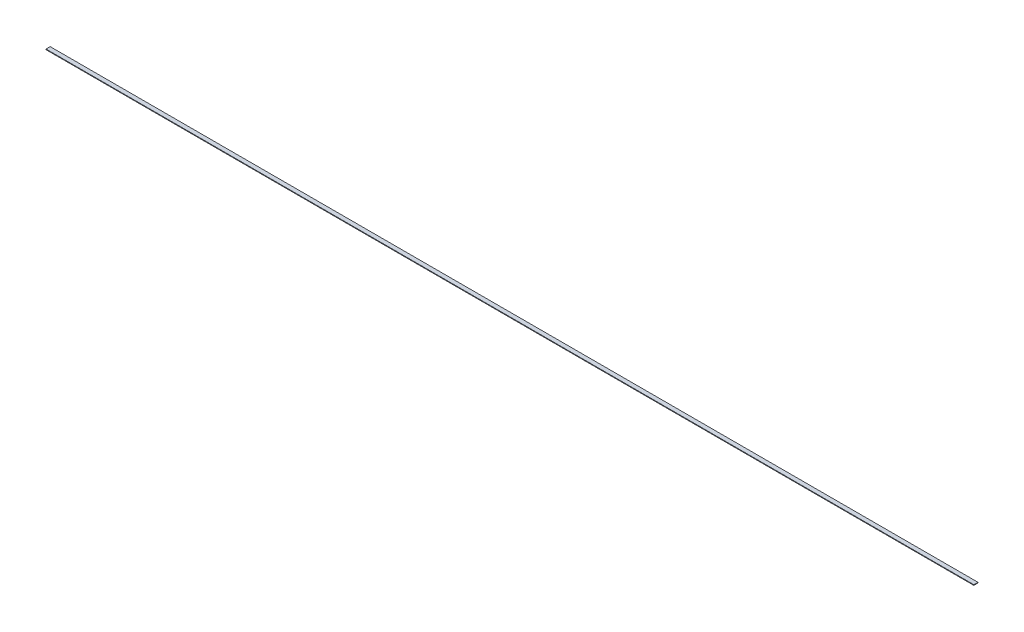
ISO-10303-21;
HEADER;
FILE_DESCRIPTION(('STEP AP214'),'2;1');
FILE_NAME('part.step','',(''),(''),'','','');
FILE_SCHEMA(('AUTOMOTIVE_DESIGN { 1 0 10303 214 1 1 1 1 }'));
ENDSEC;
DATA;
#1=APPLICATION_CONTEXT('core data for automotive mechanical design processes');
#2=APPLICATION_PROTOCOL_DEFINITION('international standard','automotive_design',2000,#1);
#3=PRODUCT_CONTEXT('',#1,'mechanical');
#4=PRODUCT('Part','Part','',(#3));
#5=PRODUCT_RELATED_PRODUCT_CATEGORY('part','',(#4));
#6=PRODUCT_DEFINITION_FORMATION('','',#4);
#7=PRODUCT_DEFINITION_CONTEXT('part definition',#1,'design');
#8=PRODUCT_DEFINITION('design','',#6,#7);
#9=PRODUCT_DEFINITION_SHAPE('','',#8);
#10=(LENGTH_UNIT() NAMED_UNIT(*) SI_UNIT(.MILLI.,.METRE.));
#11=(NAMED_UNIT(*) PLANE_ANGLE_UNIT() SI_UNIT($,.RADIAN.));
#12=(NAMED_UNIT(*) SI_UNIT($,.STERADIAN.) SOLID_ANGLE_UNIT());
#13=UNCERTAINTY_MEASURE_WITH_UNIT(LENGTH_MEASURE(1.E-05),#10,'distance_accuracy_value','');
#14=(GEOMETRIC_REPRESENTATION_CONTEXT(3) GLOBAL_UNCERTAINTY_ASSIGNED_CONTEXT((#13)) GLOBAL_UNIT_ASSIGNED_CONTEXT((#10,
#11,#12)) REPRESENTATION_CONTEXT('',''));
#15=CARTESIAN_POINT('',(0.,0.,0.));
#16=DIRECTION('',(0.,0.,1.));
#17=DIRECTION('',(1.,0.,0.));
#18=AXIS2_PLACEMENT_3D('',#15,#16,#17);
#19=CARTESIAN_POINT('',(1236.6625,0.,0.));
#20=DIRECTION('',(0.,0.,-1.));
#21=DIRECTION('',(-1.,0.,0.));
#22=AXIS2_PLACEMENT_3D('',#19,#20,#21);
#23=PLANE('',#22);
#24=DIRECTION('',(0.,-1.,0.));
#25=VECTOR('',#24,1.);
#26=CARTESIAN_POINT('',(0.,0.,0.));
#27=LINE('',#26,#25);
#28=CARTESIAN_POINT('',(0.,0.79375,0.));
#29=VERTEX_POINT('',#28);
#30=CARTESIAN_POINT('',(0.,0.,0.));
#31=VERTEX_POINT('',#30);
#32=EDGE_CURVE('E107',#29,#31,#27,.T.);
#33=ORIENTED_EDGE('',*,*,#32,.T.);
#34=DIRECTION('',(-1.,0.,0.));
#35=VECTOR('',#34,1.);
#36=CARTESIAN_POINT('',(1236.6625,0.,0.));
#37=LINE('',#36,#35);
#38=CARTESIAN_POINT('',(1236.6625,0.,0.));
#39=VERTEX_POINT('',#38);
#40=EDGE_CURVE('E11',#39,#31,#37,.T.);
#41=ORIENTED_EDGE('',*,*,#40,.F.);
#42=DIRECTION('',(0.,-1.,0.));
#43=VECTOR('',#42,1.);
#44=CARTESIAN_POINT('',(1236.6625,0.,0.));
#45=LINE('',#44,#43);
#46=CARTESIAN_POINT('',(1236.6625,0.79375,0.));
#47=VERTEX_POINT('',#46);
#48=EDGE_CURVE('E91',#47,#39,#45,.T.);
#49=ORIENTED_EDGE('',*,*,#48,.F.);
#50=DIRECTION('',(-1.,0.,0.));
#51=VECTOR('',#50,1.);
#52=CARTESIAN_POINT('',(1236.6625,0.79375,0.));
#53=LINE('',#52,#51);
#54=EDGE_CURVE('E103',#47,#29,#53,.T.);
#55=ORIENTED_EDGE('',*,*,#54,.T.);
#56=EDGE_LOOP('',(#33,#41,#49,#55));
#57=FACE_BOUND('',#56,.T.);
#58=ADVANCED_FACE('F39',(#57),#23,.F.);
#59=CARTESIAN_POINT('',(1236.6625,0.,0.));
#60=DIRECTION('',(0.,1.,0.));
#61=DIRECTION('',(0.,0.,1.));
#62=AXIS2_PLACEMENT_3D('',#59,#60,#61);
#63=PLANE('',#62);
#64=DIRECTION('',(0.,0.,-1.));
#65=VECTOR('',#64,1.);
#66=CARTESIAN_POINT('',(0.,0.,0.));
#67=LINE('',#66,#65);
#68=CARTESIAN_POINT('',(0.,0.,-5.55625));
#69=VERTEX_POINT('',#68);
#70=EDGE_CURVE('E96',#31,#69,#67,.T.);
#71=ORIENTED_EDGE('',*,*,#70,.T.);
#72=DIRECTION('',(-1.,0.,0.));
#73=VECTOR('',#72,1.);
#74=CARTESIAN_POINT('',(1236.6625,0.,-5.55625));
#75=LINE('',#74,#73);
#76=CARTESIAN_POINT('',(1236.6625,0.,-5.55625));
#77=VERTEX_POINT('',#76);
#78=EDGE_CURVE('E48',#77,#69,#75,.T.);
#79=ORIENTED_EDGE('',*,*,#78,.F.);
#80=DIRECTION('',(0.,0.,-1.));
#81=VECTOR('',#80,1.);
#82=CARTESIAN_POINT('',(1236.6625,0.,0.));
#83=LINE('',#82,#81);
#84=EDGE_CURVE('E86',#39,#77,#83,.T.);
#85=ORIENTED_EDGE('',*,*,#84,.F.);
#86=ORIENTED_EDGE('',*,*,#40,.T.);
#87=EDGE_LOOP('',(#71,#79,#85,#86));
#88=FACE_BOUND('',#87,.T.);
#89=ADVANCED_FACE('F95',(#88),#63,.F.);
#90=CARTESIAN_POINT('',(1236.6625,0.,-5.55625));
#91=DIRECTION('',(0.,0.,1.));
#92=DIRECTION('',(1.,0.,0.));
#93=AXIS2_PLACEMENT_3D('',#90,#91,#92);
#94=PLANE('',#93);
#95=DIRECTION('',(0.,1.,0.));
#96=VECTOR('',#95,1.);
#97=CARTESIAN_POINT('',(0.,0.,-5.55625));
#98=LINE('',#97,#96);
#99=CARTESIAN_POINT('',(0.,0.79375,-5.55625));
#100=VERTEX_POINT('',#99);
#101=EDGE_CURVE('E73',#69,#100,#98,.T.);
#102=ORIENTED_EDGE('',*,*,#101,.T.);
#103=DIRECTION('',(-1.,0.,0.));
#104=VECTOR('',#103,1.);
#105=CARTESIAN_POINT('',(1236.6625,0.79375,-5.55625));
#106=LINE('',#105,#104);
#107=CARTESIAN_POINT('',(1236.6625,0.79375,-5.55625));
#108=VERTEX_POINT('',#107);
#109=EDGE_CURVE('E98',#108,#100,#106,.T.);
#110=ORIENTED_EDGE('',*,*,#109,.F.);
#111=DIRECTION('',(0.,1.,0.));
#112=VECTOR('',#111,1.);
#113=CARTESIAN_POINT('',(1236.6625,0.,-5.55625));
#114=LINE('',#113,#112);
#115=EDGE_CURVE('E89',#77,#108,#114,.T.);
#116=ORIENTED_EDGE('',*,*,#115,.F.);
#117=ORIENTED_EDGE('',*,*,#78,.T.);
#118=EDGE_LOOP('',(#102,#110,#116,#117));
#119=FACE_BOUND('',#118,.T.);
#120=ADVANCED_FACE('F99',(#119),#94,.F.);
#121=CARTESIAN_POINT('',(1236.6625,0.79375,0.));
#122=DIRECTION('',(0.,-1.,0.));
#123=DIRECTION('',(0.,0.,-1.));
#124=AXIS2_PLACEMENT_3D('',#121,#122,#123);
#125=PLANE('',#124);
#126=DIRECTION('',(0.,0.,1.));
#127=VECTOR('',#126,1.);
#128=CARTESIAN_POINT('',(0.,0.79375,0.));
#129=LINE('',#128,#127);
#130=EDGE_CURVE('E79',#100,#29,#129,.T.);
#131=ORIENTED_EDGE('',*,*,#130,.T.);
#132=ORIENTED_EDGE('',*,*,#54,.F.);
#133=DIRECTION('',(0.,0.,1.));
#134=VECTOR('',#133,1.);
#135=CARTESIAN_POINT('',(1236.6625,0.79375,0.));
#136=LINE('',#135,#134);
#137=EDGE_CURVE('E56',#108,#47,#136,.T.);
#138=ORIENTED_EDGE('',*,*,#137,.F.);
#139=ORIENTED_EDGE('',*,*,#109,.T.);
#140=EDGE_LOOP('',(#131,#132,#138,#139));
#141=FACE_BOUND('',#140,.T.);
#142=ADVANCED_FACE('F120',(#141),#125,.F.);
#143=CARTESIAN_POINT('',(1236.6625,0.,0.));
#144=DIRECTION('',(-1.,0.,0.));
#145=DIRECTION('',(0.,0.,1.));
#146=AXIS2_PLACEMENT_3D('',#143,#144,#145);
#147=PLANE('',#146);
#148=ORIENTED_EDGE('',*,*,#48,.T.);
#149=ORIENTED_EDGE('',*,*,#84,.T.);
#150=ORIENTED_EDGE('',*,*,#115,.T.);
#151=ORIENTED_EDGE('',*,*,#137,.T.);
#152=EDGE_LOOP('',(#148,#149,#150,#151));
#153=FACE_BOUND('',#152,.T.);
#154=ADVANCED_FACE('F87',(#153),#147,.F.);
#155=CARTESIAN_POINT('',(0.,0.,0.));
#156=DIRECTION('',(-1.,0.,0.));
#157=DIRECTION('',(0.,0.,1.));
#158=AXIS2_PLACEMENT_3D('',#155,#156,#157);
#159=PLANE('',#158);
#160=ORIENTED_EDGE('',*,*,#32,.F.);
#161=ORIENTED_EDGE('',*,*,#130,.F.);
#162=ORIENTED_EDGE('',*,*,#101,.F.);
#163=ORIENTED_EDGE('',*,*,#70,.F.);
#164=EDGE_LOOP('',(#160,#161,#162,#163));
#165=FACE_BOUND('',#164,.T.);
#166=ADVANCED_FACE('F123',(#165),#159,.T.);
#167=CLOSED_SHELL('',(#58,#89,#120,#142,#154,#166));
#168=MANIFOLD_SOLID_BREP('B2',#167);
#169=ADVANCED_BREP_SHAPE_REPRESENTATION('',(#18,#168),#14);
#170=SHAPE_DEFINITION_REPRESENTATION(#9,#169);
ENDSEC;
END-ISO-10303-21;
